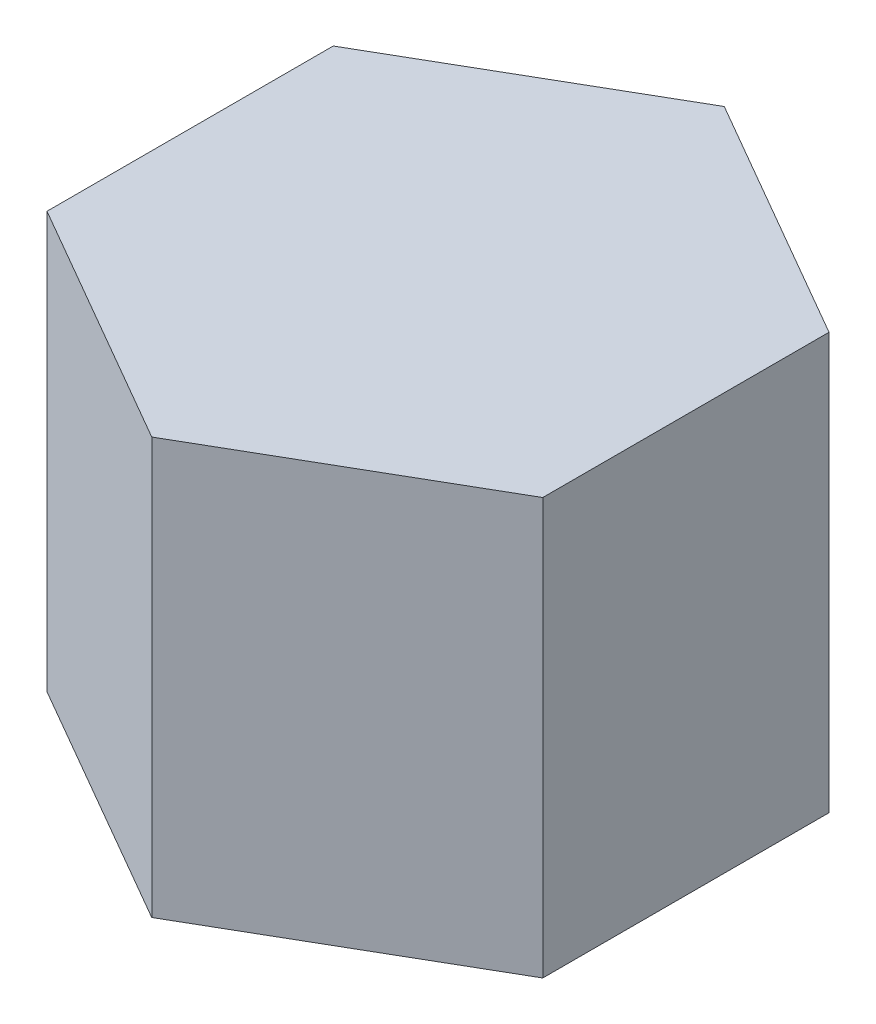
ISO-10303-21;
HEADER;
FILE_DESCRIPTION(('STEP AP214'),'2;1');
FILE_NAME('part.step','',(''),(''),'','','');
FILE_SCHEMA(('AUTOMOTIVE_DESIGN { 1 0 10303 214 1 1 1 1 }'));
ENDSEC;
DATA;
#1=APPLICATION_CONTEXT('core data for automotive mechanical design processes');
#2=APPLICATION_PROTOCOL_DEFINITION('international standard','automotive_design',2000,#1);
#3=PRODUCT_CONTEXT('',#1,'mechanical');
#4=PRODUCT('Part','Part','',(#3));
#5=PRODUCT_RELATED_PRODUCT_CATEGORY('part','',(#4));
#6=PRODUCT_DEFINITION_FORMATION('','',#4);
#7=PRODUCT_DEFINITION_CONTEXT('part definition',#1,'design');
#8=PRODUCT_DEFINITION('design','',#6,#7);
#9=PRODUCT_DEFINITION_SHAPE('','',#8);
#10=(LENGTH_UNIT() NAMED_UNIT(*) SI_UNIT(.MILLI.,.METRE.));
#11=(NAMED_UNIT(*) PLANE_ANGLE_UNIT() SI_UNIT($,.RADIAN.));
#12=(NAMED_UNIT(*) SI_UNIT($,.STERADIAN.) SOLID_ANGLE_UNIT());
#13=UNCERTAINTY_MEASURE_WITH_UNIT(LENGTH_MEASURE(1.E-05),#10,'distance_accuracy_value','');
#14=(GEOMETRIC_REPRESENTATION_CONTEXT(3) GLOBAL_UNCERTAINTY_ASSIGNED_CONTEXT((#13)) GLOBAL_UNIT_ASSIGNED_CONTEXT((#10,
#11,#12)) REPRESENTATION_CONTEXT('',''));
#15=CARTESIAN_POINT('',(0.,0.,0.));
#16=DIRECTION('',(0.,0.,1.));
#17=DIRECTION('',(1.,0.,0.));
#18=AXIS2_PLACEMENT_3D('',#15,#16,#17);
#19=CARTESIAN_POINT('',(207.339551417382,-147.556598747966,293.414022028063));
#20=DIRECTION('',(-0.500000000000062,0.,-0.866025403784403));
#21=DIRECTION('',(-0.866025403784403,0.,0.500000000000062));
#22=AXIS2_PLACEMENT_3D('',#19,#20,#21);
#23=PLANE('',#22);
#24=CARTESIAN_POINT('',(207.642660308706,-147.047793579175,293.239022028063));
#25=DIRECTION('',(-0.866025403784403,0.,0.500000000000062));
#26=VECTOR('',#25,1.);
#27=LINE('',#24,#26);
#28=CARTESIAN_POINT('',(207.642660308706,-147.047793579175,293.239022028063));
#29=VERTEX_POINT('',#28);
#30=CARTESIAN_POINT('',(207.339551417382,-147.047793579175,293.414022028063));
#31=VERTEX_POINT('',#30);
#32=EDGE_CURVE('E170',#29,#31,#27,.T.);
#33=ORIENTED_EDGE('',*,*,#32,.T.);
#34=CARTESIAN_POINT('',(207.339551417382,-147.556598747966,293.414022028063));
#35=DIRECTION('',(0.,1.,0.));
#36=VECTOR('',#35,1.);
#37=LINE('',#34,#36);
#38=CARTESIAN_POINT('',(207.339551417382,-147.556598747966,293.414022028063));
#39=VERTEX_POINT('',#38);
#40=EDGE_CURVE('E35',#39,#31,#37,.T.);
#41=ORIENTED_EDGE('',*,*,#40,.F.);
#42=CARTESIAN_POINT('',(207.642660308706,-147.556598747966,293.239022028063));
#43=DIRECTION('',(-0.866025403784403,0.,0.500000000000062));
#44=VECTOR('',#43,1.);
#45=LINE('',#42,#44);
#46=CARTESIAN_POINT('',(207.642660308706,-147.556598747966,293.239022028063));
#47=VERTEX_POINT('',#46);
#48=EDGE_CURVE('E159',#47,#39,#45,.T.);
#49=ORIENTED_EDGE('',*,*,#48,.F.);
#50=CARTESIAN_POINT('',(207.642660308706,-147.556598747966,293.239022028063));
#51=DIRECTION('',(0.,1.,0.));
#52=VECTOR('',#51,1.);
#53=LINE('',#50,#52);
#54=EDGE_CURVE('E10',#47,#29,#53,.T.);
#55=ORIENTED_EDGE('',*,*,#54,.T.);
#56=EDGE_LOOP('',(#33,#41,#49,#55));
#57=FACE_BOUND('',#56,.T.);
#58=ADVANCED_FACE('F16',(#57),#23,.F.);
#59=CARTESIAN_POINT('',(207.642660308706,-147.556598747966,291.594471220494));
#60=DIRECTION('',(-1.,0.,0.));
#61=DIRECTION('',(0.,-1.,0.));
#62=AXIS2_PLACEMENT_3D('',#59,#60,#61);
#63=PLANE('',#62);
#64=CARTESIAN_POINT('',(207.642660308706,-147.047793579175,292.889022028063));
#65=DIRECTION('',(0.,0.,1.));
#66=VECTOR('',#65,1.);
#67=LINE('',#64,#66);
#68=CARTESIAN_POINT('',(207.642660308706,-147.047793579175,292.889022028063));
#69=VERTEX_POINT('',#68);
#70=EDGE_CURVE('E167',#69,#29,#67,.T.);
#71=ORIENTED_EDGE('',*,*,#70,.T.);
#72=ORIENTED_EDGE('',*,*,#54,.F.);
#73=CARTESIAN_POINT('',(207.642660308706,-147.556598747966,292.889022028063));
#74=DIRECTION('',(0.,0.,1.));
#75=VECTOR('',#74,1.);
#76=LINE('',#73,#75);
#77=CARTESIAN_POINT('',(207.642660308706,-147.556598747966,292.889022028063));
#78=VERTEX_POINT('',#77);
#79=EDGE_CURVE('E156',#78,#47,#76,.T.);
#80=ORIENTED_EDGE('',*,*,#79,.F.);
#81=CARTESIAN_POINT('',(207.642660308706,-147.556598747966,292.889022028063));
#82=DIRECTION('',(0.,1.,0.));
#83=VECTOR('',#82,1.);
#84=LINE('',#81,#83);
#85=EDGE_CURVE('E27',#78,#69,#84,.T.);
#86=ORIENTED_EDGE('',*,*,#85,.T.);
#87=EDGE_LOOP('',(#71,#72,#80,#86));
#88=FACE_BOUND('',#87,.T.);
#89=ADVANCED_FACE('F189',(#88),#63,.F.);
#90=CARTESIAN_POINT('',(207.642660308706,-147.556598747966,292.889022028063));
#91=DIRECTION('',(-0.500000000000028,0.,0.866025403784422));
#92=DIRECTION('',(0.866025403784423,0.,0.500000000000028));
#93=AXIS2_PLACEMENT_3D('',#90,#91,#92);
#94=PLANE('',#93);
#95=CARTESIAN_POINT('',(207.339551417381,-147.047793579175,292.714022028063));
#96=DIRECTION('',(0.866025403784422,0.,0.500000000000028));
#97=VECTOR('',#96,1.);
#98=LINE('',#95,#97);
#99=CARTESIAN_POINT('',(207.339551417382,-147.047793579175,292.714022028063));
#100=VERTEX_POINT('',#99);
#101=EDGE_CURVE('E163',#100,#69,#98,.T.);
#102=ORIENTED_EDGE('',*,*,#101,.T.);
#103=ORIENTED_EDGE('',*,*,#85,.F.);
#104=CARTESIAN_POINT('',(207.339551417381,-147.556598747966,292.714022028063));
#105=DIRECTION('',(0.866025403784422,0.,0.500000000000028));
#106=VECTOR('',#105,1.);
#107=LINE('',#104,#106);
#108=CARTESIAN_POINT('',(207.339551417382,-147.556598747966,292.714022028063));
#109=VERTEX_POINT('',#108);
#110=EDGE_CURVE('E106',#109,#78,#107,.T.);
#111=ORIENTED_EDGE('',*,*,#110,.F.);
#112=CARTESIAN_POINT('',(207.339551417382,-147.556598747966,292.714022028063));
#113=DIRECTION('',(0.,1.,0.));
#114=VECTOR('',#113,1.);
#115=LINE('',#112,#114);
#116=EDGE_CURVE('E94',#109,#100,#115,.T.);
#117=ORIENTED_EDGE('',*,*,#116,.T.);
#118=EDGE_LOOP('',(#102,#103,#111,#117));
#119=FACE_BOUND('',#118,.T.);
#120=ADVANCED_FACE('F198',(#119),#94,.F.);
#121=CARTESIAN_POINT('',(207.339551417382,-147.556598747966,292.714022028063));
#122=DIRECTION('',(0.499999999999943,0.,0.866025403784471));
#123=DIRECTION('',(0.866025403784471,0.,-0.499999999999943));
#124=AXIS2_PLACEMENT_3D('',#121,#122,#123);
#125=PLANE('',#124);
#126=CARTESIAN_POINT('',(207.036442526057,-147.047793579175,292.889022028063));
#127=DIRECTION('',(0.866025403784471,0.,-0.499999999999943));
#128=VECTOR('',#127,1.);
#129=LINE('',#126,#128);
#130=CARTESIAN_POINT('',(207.036442526057,-147.047793579175,292.889022028063));
#131=VERTEX_POINT('',#130);
#132=EDGE_CURVE('E162',#131,#100,#129,.T.);
#133=ORIENTED_EDGE('',*,*,#132,.T.);
#134=ORIENTED_EDGE('',*,*,#116,.F.);
#135=CARTESIAN_POINT('',(207.036442526057,-147.556598747966,292.889022028063));
#136=DIRECTION('',(0.866025403784471,0.,-0.499999999999943));
#137=VECTOR('',#136,1.);
#138=LINE('',#135,#137);
#139=CARTESIAN_POINT('',(207.036442526057,-147.556598747966,292.889022028063));
#140=VERTEX_POINT('',#139);
#141=EDGE_CURVE('E98',#140,#109,#138,.T.);
#142=ORIENTED_EDGE('',*,*,#141,.F.);
#143=CARTESIAN_POINT('',(207.036442526057,-147.556598747966,292.889022028063));
#144=DIRECTION('',(0.,1.,0.));
#145=VECTOR('',#144,1.);
#146=LINE('',#143,#145);
#147=EDGE_CURVE('E79',#140,#131,#146,.T.);
#148=ORIENTED_EDGE('',*,*,#147,.T.);
#149=EDGE_LOOP('',(#133,#134,#142,#148));
#150=FACE_BOUND('',#149,.T.);
#151=ADVANCED_FACE('F100',(#150),#125,.F.);
#152=CARTESIAN_POINT('',(207.036442526057,-147.556598747966,291.594471220494));
#153=DIRECTION('',(1.,0.,0.));
#154=DIRECTION('',(0.,1.,0.));
#155=AXIS2_PLACEMENT_3D('',#152,#153,#154);
#156=PLANE('',#155);
#157=CARTESIAN_POINT('',(207.036442526057,-147.047793579175,293.239022028063));
#158=DIRECTION('',(0.,0.,-1.));
#159=VECTOR('',#158,1.);
#160=LINE('',#157,#159);
#161=CARTESIAN_POINT('',(207.036442526057,-147.047793579175,293.239022028063));
#162=VERTEX_POINT('',#161);
#163=EDGE_CURVE('E88',#162,#131,#160,.T.);
#164=ORIENTED_EDGE('',*,*,#163,.T.);
#165=ORIENTED_EDGE('',*,*,#147,.F.);
#166=CARTESIAN_POINT('',(207.036442526057,-147.556598747966,293.239022028063));
#167=DIRECTION('',(0.,0.,-1.));
#168=VECTOR('',#167,1.);
#169=LINE('',#166,#168);
#170=CARTESIAN_POINT('',(207.036442526057,-147.556598747966,293.239022028063));
#171=VERTEX_POINT('',#170);
#172=EDGE_CURVE('E84',#171,#140,#169,.T.);
#173=ORIENTED_EDGE('',*,*,#172,.F.);
#174=CARTESIAN_POINT('',(207.036442526057,-147.556598747966,293.239022028063));
#175=DIRECTION('',(0.,1.,0.));
#176=VECTOR('',#175,1.);
#177=LINE('',#174,#176);
#178=EDGE_CURVE('E58',#171,#162,#177,.T.);
#179=ORIENTED_EDGE('',*,*,#178,.T.);
#180=EDGE_LOOP('',(#164,#165,#173,#179));
#181=FACE_BOUND('',#180,.T.);
#182=ADVANCED_FACE('F82',(#181),#156,.F.);
#183=CARTESIAN_POINT('',(207.036442526057,-147.556598747966,293.239022028063));
#184=DIRECTION('',(0.500000000000062,0.,-0.866025403784403));
#185=DIRECTION('',(-0.866025403784403,0.,-0.500000000000062));
#186=AXIS2_PLACEMENT_3D('',#183,#184,#185);
#187=PLANE('',#186);
#188=CARTESIAN_POINT('',(207.339551417382,-147.047793579175,293.414022028063));
#189=DIRECTION('',(-0.866025403784403,0.,-0.500000000000062));
#190=VECTOR('',#189,1.);
#191=LINE('',#188,#190);
#192=EDGE_CURVE('E160',#31,#162,#191,.T.);
#193=ORIENTED_EDGE('',*,*,#192,.T.);
#194=ORIENTED_EDGE('',*,*,#178,.F.);
#195=CARTESIAN_POINT('',(207.339551417382,-147.556598747966,293.414022028063));
#196=DIRECTION('',(-0.866025403784403,0.,-0.500000000000062));
#197=VECTOR('',#196,1.);
#198=LINE('',#195,#197);
#199=EDGE_CURVE('E112',#39,#171,#198,.T.);
#200=ORIENTED_EDGE('',*,*,#199,.F.);
#201=ORIENTED_EDGE('',*,*,#40,.T.);
#202=EDGE_LOOP('',(#193,#194,#200,#201));
#203=FACE_BOUND('',#202,.T.);
#204=ADVANCED_FACE('F131',(#203),#187,.F.);
#205=CARTESIAN_POINT('',(206.491105863044,-147.556598747966,291.594471220494));
#206=DIRECTION('',(0.,1.,0.));
#207=DIRECTION('',(-1.,0.,0.));
#208=AXIS2_PLACEMENT_3D('',#205,#206,#207);
#209=PLANE('',#208);
#210=ORIENTED_EDGE('',*,*,#48,.T.);
#211=ORIENTED_EDGE('',*,*,#199,.T.);
#212=ORIENTED_EDGE('',*,*,#172,.T.);
#213=ORIENTED_EDGE('',*,*,#141,.T.);
#214=ORIENTED_EDGE('',*,*,#110,.T.);
#215=ORIENTED_EDGE('',*,*,#79,.T.);
#216=EDGE_LOOP('',(#210,#211,#212,#213,#214,#215));
#217=FACE_BOUND('',#216,.T.);
#218=ADVANCED_FACE('F111',(#217),#209,.F.);
#219=CARTESIAN_POINT('',(206.491105863044,-147.047793579175,291.594471220494));
#220=DIRECTION('',(0.,1.,0.));
#221=DIRECTION('',(-1.,0.,0.));
#222=AXIS2_PLACEMENT_3D('',#219,#220,#221);
#223=PLANE('',#222);
#224=ORIENTED_EDGE('',*,*,#32,.F.);
#225=ORIENTED_EDGE('',*,*,#70,.F.);
#226=ORIENTED_EDGE('',*,*,#101,.F.);
#227=ORIENTED_EDGE('',*,*,#132,.F.);
#228=ORIENTED_EDGE('',*,*,#163,.F.);
#229=ORIENTED_EDGE('',*,*,#192,.F.);
#230=EDGE_LOOP('',(#224,#225,#226,#227,#228,#229));
#231=FACE_BOUND('',#230,.T.);
#232=ADVANCED_FACE('F130',(#231),#223,.T.);
#233=CLOSED_SHELL('',(#58,#89,#120,#151,#182,#204,#218,#232));
#234=MANIFOLD_SOLID_BREP('B1',#233);
#235=ADVANCED_BREP_SHAPE_REPRESENTATION('',(#18,#234),#14);
#236=SHAPE_DEFINITION_REPRESENTATION(#9,#235);
ENDSEC;
END-ISO-10303-21;
